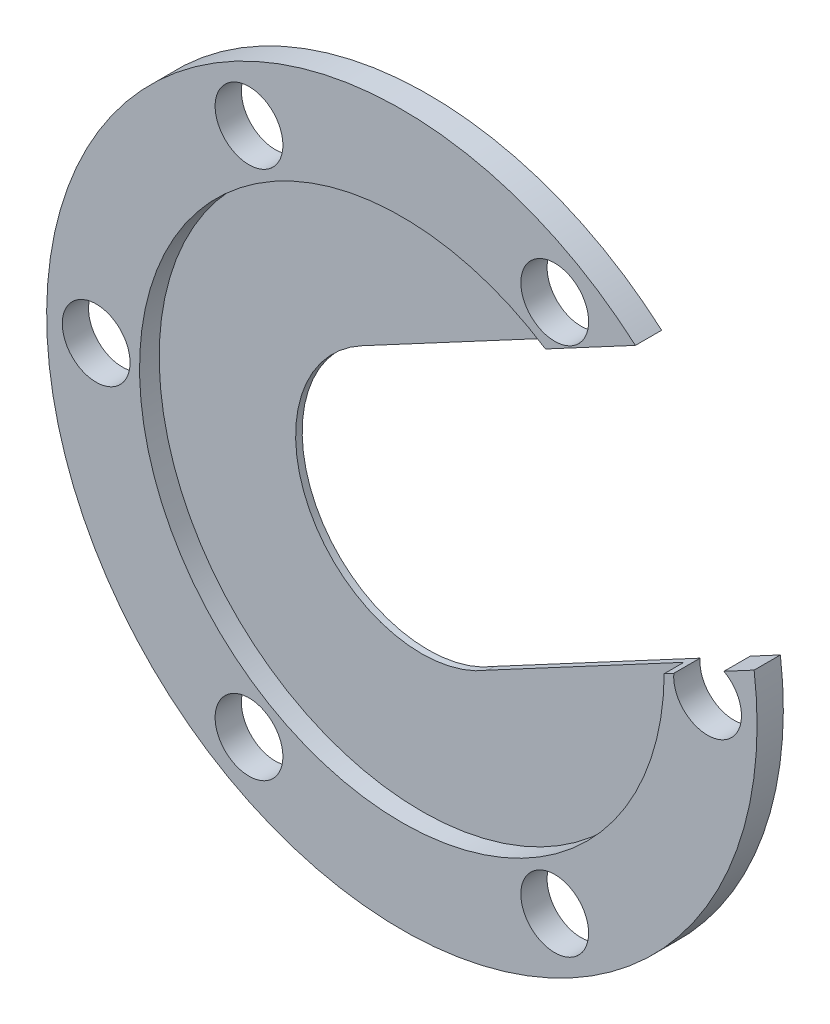
ISO-10303-21;
HEADER;
FILE_DESCRIPTION(('STEP AP214'),'2;1');
FILE_NAME('part.step','',(''),(''),'','','');
FILE_SCHEMA(('AUTOMOTIVE_DESIGN { 1 0 10303 214 1 1 1 1 }'));
ENDSEC;
DATA;
#1=APPLICATION_CONTEXT('core data for automotive mechanical design processes');
#2=APPLICATION_PROTOCOL_DEFINITION('international standard','automotive_design',2000,#1);
#3=PRODUCT_CONTEXT('',#1,'mechanical');
#4=PRODUCT('Part','Part','',(#3));
#5=PRODUCT_RELATED_PRODUCT_CATEGORY('part','',(#4));
#6=PRODUCT_DEFINITION_FORMATION('','',#4);
#7=PRODUCT_DEFINITION_CONTEXT('part definition',#1,'design');
#8=PRODUCT_DEFINITION('design','',#6,#7);
#9=PRODUCT_DEFINITION_SHAPE('','',#8);
#10=(LENGTH_UNIT() NAMED_UNIT(*) SI_UNIT(.MILLI.,.METRE.));
#11=(NAMED_UNIT(*) PLANE_ANGLE_UNIT() SI_UNIT($,.RADIAN.));
#12=(NAMED_UNIT(*) SI_UNIT($,.STERADIAN.) SOLID_ANGLE_UNIT());
#13=UNCERTAINTY_MEASURE_WITH_UNIT(LENGTH_MEASURE(1.E-05),#10,'distance_accuracy_value','');
#14=(GEOMETRIC_REPRESENTATION_CONTEXT(3) GLOBAL_UNCERTAINTY_ASSIGNED_CONTEXT((#13)) GLOBAL_UNIT_ASSIGNED_CONTEXT((#10,
#11,#12)) REPRESENTATION_CONTEXT('',''));
#15=CARTESIAN_POINT('',(0.,0.,0.));
#16=DIRECTION('',(0.,0.,1.));
#17=DIRECTION('',(1.,0.,0.));
#18=AXIS2_PLACEMENT_3D('',#15,#16,#17);
#19=CARTESIAN_POINT('',(-4.33427512630535E-09,0.,3.175));
#20=DIRECTION('',(0.,0.,1.));
#21=DIRECTION('',(1.,0.,0.));
#22=AXIS2_PLACEMENT_3D('',#19,#20,#21);
#23=PLANE('',#22);
#24=CARTESIAN_POINT('',(-36.9951,0.,3.175));
#25=DIRECTION('',(0.,0.,1.));
#26=DIRECTION('',(1.,0.,0.));
#27=AXIS2_PLACEMENT_3D('',#24,#25,#26);
#28=CIRCLE('',#27,4.10210000000001);
#29=CARTESIAN_POINT('',(-32.893,0.,3.175));
#30=VERTEX_POINT('',#29);
#31=EDGE_CURVE('E125',#30,#30,#28,.T.);
#32=ORIENTED_EDGE('',*,*,#31,.F.);
#33=EDGE_LOOP('',(#32));
#34=FACE_BOUND('',#33,.T.);
#35=CARTESIAN_POINT('',(18.49755,-32.0386964254,3.175));
#36=DIRECTION('',(0.,0.,1.));
#37=DIRECTION('',(1.,0.,0.));
#38=AXIS2_PLACEMENT_3D('',#35,#36,#37);
#39=CIRCLE('',#38,4.10210000000002);
#40=CARTESIAN_POINT('',(22.59965,-32.0386964254,3.175));
#41=VERTEX_POINT('',#40);
#42=EDGE_CURVE('E141',#41,#41,#39,.T.);
#43=ORIENTED_EDGE('',*,*,#42,.F.);
#44=EDGE_LOOP('',(#43));
#45=FACE_BOUND('',#44,.T.);
#46=CARTESIAN_POINT('',(18.49755,32.0386964254,3.175));
#47=DIRECTION('',(0.,0.,1.));
#48=DIRECTION('',(1.,0.,0.));
#49=AXIS2_PLACEMENT_3D('',#46,#47,#48);
#50=CIRCLE('',#49,4.10210000000002);
#51=CARTESIAN_POINT('',(22.59965,32.0386964254,3.175));
#52=VERTEX_POINT('',#51);
#53=EDGE_CURVE('E153',#52,#52,#50,.T.);
#54=ORIENTED_EDGE('',*,*,#53,.F.);
#55=EDGE_LOOP('',(#54));
#56=FACE_BOUND('',#55,.T.);
#57=CARTESIAN_POINT('',(-18.49755,32.0386964254,3.175));
#58=DIRECTION('',(0.,0.,1.));
#59=DIRECTION('',(1.,0.,0.));
#60=AXIS2_PLACEMENT_3D('',#57,#58,#59);
#61=CIRCLE('',#60,4.10210000000002);
#62=CARTESIAN_POINT('',(-14.39545,32.0386964254,3.175));
#63=VERTEX_POINT('',#62);
#64=EDGE_CURVE('E159',#63,#63,#61,.T.);
#65=ORIENTED_EDGE('',*,*,#64,.F.);
#66=EDGE_LOOP('',(#65));
#67=FACE_BOUND('',#66,.T.);
#68=CARTESIAN_POINT('',(-18.49755,-32.0386964254,3.175));
#69=DIRECTION('',(0.,0.,1.));
#70=DIRECTION('',(1.,0.,0.));
#71=AXIS2_PLACEMENT_3D('',#68,#69,#70);
#72=CIRCLE('',#71,4.10210000000002);
#73=CARTESIAN_POINT('',(-14.39545,-32.0386964254,3.175));
#74=VERTEX_POINT('',#73);
#75=EDGE_CURVE('E135',#74,#74,#72,.T.);
#76=ORIENTED_EDGE('',*,*,#75,.F.);
#77=EDGE_LOOP('',(#76));
#78=FACE_BOUND('',#77,.T.);
#79=CARTESIAN_POINT('',(-4.33427512630535E-09,0.,3.175));
#80=DIRECTION('',(0.,0.,1.));
#81=DIRECTION('',(1.,0.,0.));
#82=AXIS2_PLACEMENT_3D('',#79,#80,#81);
#83=CIRCLE('',#82,31.75);
#84=CARTESIAN_POINT('',(17.3781643817542,26.571825352619,3.175));
#85=VERTEX_POINT('',#84);
#86=CARTESIAN_POINT('',(31.7488338882831,-0.272114790092504,3.175));
#87=VERTEX_POINT('',#86);
#88=EDGE_CURVE('E114',#85,#87,#83,.T.);
#89=ORIENTED_EDGE('',*,*,#88,.F.);
#90=DIRECTION('',(0.88188321776636,0.471467910066052,0.));
#91=VECTOR('',#90,1.);
#92=CARTESIAN_POINT('',(-7.1851709537409,13.4399002387593,3.175));
#93=LINE('',#92,#91);
#94=CARTESIAN_POINT('',(28.2643352209889,32.3917345092935,3.175));
#95=VERTEX_POINT('',#94);
#96=EDGE_CURVE('E196',#85,#95,#93,.T.);
#97=ORIENTED_EDGE('',*,*,#96,.T.);
#98=CARTESIAN_POINT('',(-4.33427512630535E-09,0.,3.175));
#99=DIRECTION('',(0.,0.,1.));
#100=DIRECTION('',(1.,0.,0.));
#101=AXIS2_PLACEMENT_3D('',#98,#99,#100);
#102=CIRCLE('',#101,42.9895);
#103=CARTESIAN_POINT('',(42.6303494676654,5.54530559529202,3.175));
#104=VERTEX_POINT('',#103);
#105=EDGE_CURVE('E164',#95,#104,#102,.T.);
#106=ORIENTED_EDGE('',*,*,#105,.T.);
#107=DIRECTION('',(0.88188321776636,0.471467910066051,0.));
#108=VECTOR('',#107,1.);
#109=CARTESIAN_POINT('',(6.30706944594742,-13.8736611948441,3.175));
#110=LINE('',#109,#108);
#111=CARTESIAN_POINT('',(38.9764371684633,3.59186962943619,3.175));
#112=VERTEX_POINT('',#111);
#113=EDGE_CURVE('E194',#112,#104,#110,.T.);
#114=ORIENTED_EDGE('',*,*,#113,.F.);
#115=CARTESIAN_POINT('',(36.9951,0.,3.175));
#116=DIRECTION('',(0.,0.,1.));
#117=DIRECTION('',(1.,0.,0.));
#118=AXIS2_PLACEMENT_3D('',#115,#116,#117);
#119=CIRCLE('',#118,4.10210000000001);
#120=CARTESIAN_POINT('',(32.9077414640649,0.347454469993213,3.175));
#121=VERTEX_POINT('',#120);
#122=EDGE_CURVE('E147',#121,#112,#119,.T.);
#123=ORIENTED_EDGE('',*,*,#122,.F.);
#124=EDGE_CURVE('E104',#87,#121,#110,.T.);
#125=ORIENTED_EDGE('',*,*,#124,.F.);
#126=EDGE_LOOP('',(#89,#97,#106,#114,#123,#125));
#127=FACE_BOUND('',#126,.T.);
#128=ADVANCED_FACE('F33',(#34,#45,#56,#67,#78,#127),#23,.T.);
#129=CARTESIAN_POINT('',(-4.33427512630535E-09,0.,0.));
#130=DIRECTION('',(0.,0.,1.));
#131=DIRECTION('',(1.,0.,0.));
#132=AXIS2_PLACEMENT_3D('',#129,#130,#131);
#133=PLANE('',#132);
#134=CARTESIAN_POINT('',(-36.9951,0.,0.));
#135=DIRECTION('',(0.,0.,1.));
#136=DIRECTION('',(1.,0.,0.));
#137=AXIS2_PLACEMENT_3D('',#134,#135,#136);
#138=CIRCLE('',#137,4.10210000000001);
#139=CARTESIAN_POINT('',(-32.893,0.,0.));
#140=VERTEX_POINT('',#139);
#141=EDGE_CURVE('E121',#140,#140,#138,.T.);
#142=ORIENTED_EDGE('',*,*,#141,.T.);
#143=EDGE_LOOP('',(#142));
#144=FACE_BOUND('',#143,.T.);
#145=CARTESIAN_POINT('',(-18.49755,-32.0386964254,0.));
#146=DIRECTION('',(0.,0.,1.));
#147=DIRECTION('',(1.,0.,0.));
#148=AXIS2_PLACEMENT_3D('',#145,#146,#147);
#149=CIRCLE('',#148,4.10210000000002);
#150=CARTESIAN_POINT('',(-14.39545,-32.0386964254,0.));
#151=VERTEX_POINT('',#150);
#152=EDGE_CURVE('E133',#151,#151,#149,.T.);
#153=ORIENTED_EDGE('',*,*,#152,.T.);
#154=EDGE_LOOP('',(#153));
#155=FACE_BOUND('',#154,.T.);
#156=CARTESIAN_POINT('',(18.49755,-32.0386964254,0.));
#157=DIRECTION('',(0.,0.,1.));
#158=DIRECTION('',(1.,0.,0.));
#159=AXIS2_PLACEMENT_3D('',#156,#157,#158);
#160=CIRCLE('',#159,4.10210000000002);
#161=CARTESIAN_POINT('',(22.59965,-32.0386964254,0.));
#162=VERTEX_POINT('',#161);
#163=EDGE_CURVE('E138',#162,#162,#160,.T.);
#164=ORIENTED_EDGE('',*,*,#163,.T.);
#165=EDGE_LOOP('',(#164));
#166=FACE_BOUND('',#165,.T.);
#167=CARTESIAN_POINT('',(18.49755,32.0386964254,0.));
#168=DIRECTION('',(0.,0.,1.));
#169=DIRECTION('',(1.,0.,0.));
#170=AXIS2_PLACEMENT_3D('',#167,#168,#169);
#171=CIRCLE('',#170,4.10210000000002);
#172=CARTESIAN_POINT('',(22.59965,32.0386964254,0.));
#173=VERTEX_POINT('',#172);
#174=EDGE_CURVE('E150',#173,#173,#171,.T.);
#175=ORIENTED_EDGE('',*,*,#174,.T.);
#176=EDGE_LOOP('',(#175));
#177=FACE_BOUND('',#176,.T.);
#178=CARTESIAN_POINT('',(-18.49755,32.0386964254,0.));
#179=DIRECTION('',(0.,0.,1.));
#180=DIRECTION('',(1.,0.,0.));
#181=AXIS2_PLACEMENT_3D('',#178,#179,#180);
#182=CIRCLE('',#181,4.10210000000002);
#183=CARTESIAN_POINT('',(-14.39545,32.0386964254,0.));
#184=VERTEX_POINT('',#183);
#185=EDGE_CURVE('E156',#184,#184,#182,.T.);
#186=ORIENTED_EDGE('',*,*,#185,.T.);
#187=EDGE_LOOP('',(#186));
#188=FACE_BOUND('',#187,.T.);
#189=DIRECTION('',(0.88188321776636,0.471467910066052,0.));
#190=VECTOR('',#189,1.);
#191=CARTESIAN_POINT('',(-7.1851709537409,13.4399002387593,0.));
#192=LINE('',#191,#190);
#193=CARTESIAN_POINT('',(-7.1851709537409,13.4399002387593,0.));
#194=VERTEX_POINT('',#193);
#195=CARTESIAN_POINT('',(28.2643352209889,32.3917345092935,0.));
#196=VERTEX_POINT('',#195);
#197=EDGE_CURVE('E98',#194,#196,#192,.T.);
#198=ORIENTED_EDGE('',*,*,#197,.F.);
#199=CARTESIAN_POINT('',(-4.33427512630535E-09,0.,0.));
#200=DIRECTION('',(0.,0.,1.));
#201=DIRECTION('',(1.,0.,0.));
#202=AXIS2_PLACEMENT_3D('',#199,#200,#201);
#203=CIRCLE('',#202,15.24);
#204=CARTESIAN_POINT('',(8.03359809276662,-12.9506332514768,0.));
#205=VERTEX_POINT('',#204);
#206=EDGE_CURVE('E110',#194,#205,#203,.T.);
#207=ORIENTED_EDGE('',*,*,#206,.T.);
#208=DIRECTION('',(0.88188321776636,0.471467910066051,0.));
#209=VECTOR('',#208,1.);
#210=CARTESIAN_POINT('',(7.17033376935699,-13.4121472231605,0.));
#211=LINE('',#210,#209);
#212=CARTESIAN_POINT('',(32.9077414640649,0.347454469993213,0.));
#213=VERTEX_POINT('',#212);
#214=EDGE_CURVE('E191',#205,#213,#211,.T.);
#215=ORIENTED_EDGE('',*,*,#214,.T.);
#216=CARTESIAN_POINT('',(36.9951,0.,0.));
#217=DIRECTION('',(0.,0.,1.));
#218=DIRECTION('',(1.,0.,0.));
#219=AXIS2_PLACEMENT_3D('',#216,#217,#218);
#220=CIRCLE('',#219,4.10210000000001);
#221=CARTESIAN_POINT('',(38.9764371684633,3.59186962943619,0.));
#222=VERTEX_POINT('',#221);
#223=EDGE_CURVE('E144',#213,#222,#220,.T.);
#224=ORIENTED_EDGE('',*,*,#223,.T.);
#225=CARTESIAN_POINT('',(42.6303494676654,5.54530559529202,0.));
#226=VERTEX_POINT('',#225);
#227=EDGE_CURVE('E48',#222,#226,#211,.T.);
#228=ORIENTED_EDGE('',*,*,#227,.T.);
#229=CARTESIAN_POINT('',(-4.33427512630535E-09,0.,0.));
#230=DIRECTION('',(0.,0.,1.));
#231=DIRECTION('',(1.,0.,0.));
#232=AXIS2_PLACEMENT_3D('',#229,#230,#231);
#233=CIRCLE('',#232,42.9895);
#234=EDGE_CURVE('E113',#196,#226,#233,.T.);
#235=ORIENTED_EDGE('',*,*,#234,.F.);
#236=EDGE_LOOP('',(#198,#207,#215,#224,#228,#235));
#237=FACE_BOUND('',#236,.T.);
#238=ADVANCED_FACE('F108',(#144,#155,#166,#177,#188,#237),#133,.F.);
#239=CARTESIAN_POINT('',(-4.33427512630535E-09,0.,3.175));
#240=DIRECTION('',(0.,0.,-1.));
#241=DIRECTION('',(-1.,0.,0.));
#242=AXIS2_PLACEMENT_3D('',#239,#240,#241);
#243=CYLINDRICAL_SURFACE('',#242,42.9895);
#244=DIRECTION('',(0.,0.,-1.));
#245=VECTOR('',#244,1.);
#246=CARTESIAN_POINT('',(28.2643352209889,32.3917345092935,3.175));
#247=LINE('',#246,#245);
#248=EDGE_CURVE('E115',#196,#95,#247,.F.);
#249=ORIENTED_EDGE('',*,*,#248,.F.);
#250=ORIENTED_EDGE('',*,*,#234,.T.);
#251=DIRECTION('',(0.,0.,-1.));
#252=VECTOR('',#251,1.);
#253=CARTESIAN_POINT('',(42.6303494676654,5.54530559529202,3.175));
#254=LINE('',#253,#252);
#255=EDGE_CURVE('E184',#226,#104,#254,.F.);
#256=ORIENTED_EDGE('',*,*,#255,.T.);
#257=ORIENTED_EDGE('',*,*,#105,.F.);
#258=EDGE_LOOP('',(#249,#250,#256,#257));
#259=FACE_BOUND('',#258,.T.);
#260=ADVANCED_FACE('F35',(#259),#243,.T.);
#261=CARTESIAN_POINT('',(-4.33427512630535E-09,0.,0.79375));
#262=DIRECTION('',(0.,0.,1.));
#263=DIRECTION('',(1.,0.,0.));
#264=AXIS2_PLACEMENT_3D('',#261,#262,#263);
#265=CYLINDRICAL_SURFACE('',#264,31.75);
#266=DIRECTION('',(0.,0.,1.));
#267=VECTOR('',#266,1.);
#268=CARTESIAN_POINT('',(17.3781643817542,26.571825352619,0.79375));
#269=LINE('',#268,#267);
#270=CARTESIAN_POINT('',(17.3781643817542,26.571825352619,0.79375));
#271=VERTEX_POINT('',#270);
#272=EDGE_CURVE('E56',#85,#271,#269,.F.);
#273=ORIENTED_EDGE('',*,*,#272,.F.);
#274=ORIENTED_EDGE('',*,*,#88,.T.);
#275=DIRECTION('',(0.,0.,1.));
#276=VECTOR('',#275,1.);
#277=CARTESIAN_POINT('',(31.7488338882832,-0.272114790092511,0.79375));
#278=LINE('',#277,#276);
#279=CARTESIAN_POINT('',(31.7488338882832,-0.272114790092509,0.79375));
#280=VERTEX_POINT('',#279);
#281=EDGE_CURVE('E103',#87,#280,#278,.F.);
#282=ORIENTED_EDGE('',*,*,#281,.T.);
#283=CARTESIAN_POINT('',(-4.33427512630535E-09,0.,0.79375));
#284=DIRECTION('',(0.,0.,1.));
#285=DIRECTION('',(1.,0.,0.));
#286=AXIS2_PLACEMENT_3D('',#283,#284,#285);
#287=CIRCLE('',#286,31.75);
#288=EDGE_CURVE('E127',#271,#280,#287,.T.);
#289=ORIENTED_EDGE('',*,*,#288,.F.);
#290=EDGE_LOOP('',(#273,#274,#282,#289));
#291=FACE_BOUND('',#290,.T.);
#292=ADVANCED_FACE('F177',(#291),#265,.F.);
#293=CARTESIAN_POINT('',(-4.33427512630535E-09,0.,0.79375));
#294=DIRECTION('',(0.,0.,1.));
#295=DIRECTION('',(1.,0.,0.));
#296=AXIS2_PLACEMENT_3D('',#293,#294,#295);
#297=PLANE('',#296);
#298=CARTESIAN_POINT('',(-4.33427512630535E-09,0.,0.79375));
#299=DIRECTION('',(0.,0.,1.));
#300=DIRECTION('',(1.,0.,0.));
#301=AXIS2_PLACEMENT_3D('',#298,#299,#300);
#302=CIRCLE('',#301,15.24);
#303=CARTESIAN_POINT('',(-7.1851709537409,13.4399002387593,0.79375));
#304=VERTEX_POINT('',#303);
#305=CARTESIAN_POINT('',(8.03359809276662,-12.9506332514768,0.79375));
#306=VERTEX_POINT('',#305);
#307=EDGE_CURVE('E122',#304,#306,#302,.T.);
#308=ORIENTED_EDGE('',*,*,#307,.F.);
#309=DIRECTION('',(0.88188321776636,0.471467910066052,0.));
#310=VECTOR('',#309,1.);
#311=CARTESIAN_POINT('',(-7.1851709537409,13.4399002387593,0.79375));
#312=LINE('',#311,#310);
#313=EDGE_CURVE('E11',#304,#271,#312,.T.);
#314=ORIENTED_EDGE('',*,*,#313,.T.);
#315=ORIENTED_EDGE('',*,*,#288,.T.);
#316=DIRECTION('',(0.88188321776636,0.471467910066051,0.));
#317=VECTOR('',#316,1.);
#318=CARTESIAN_POINT('',(7.17033376935699,-13.4121472231605,0.79375));
#319=LINE('',#318,#317);
#320=EDGE_CURVE('E41',#306,#280,#319,.T.);
#321=ORIENTED_EDGE('',*,*,#320,.F.);
#322=EDGE_LOOP('',(#308,#314,#315,#321));
#323=FACE_BOUND('',#322,.T.);
#324=ADVANCED_FACE('F180',(#323),#297,.T.);
#325=CARTESIAN_POINT('',(-4.33427512630535E-09,0.,3.175));
#326=DIRECTION('',(0.,0.,-1.));
#327=DIRECTION('',(-1.,0.,0.));
#328=AXIS2_PLACEMENT_3D('',#325,#326,#327);
#329=CYLINDRICAL_SURFACE('',#328,15.24);
#330=DIRECTION('',(0.,0.,1.));
#331=VECTOR('',#330,1.);
#332=CARTESIAN_POINT('',(-7.1851709537409,13.4399002387593,-0.9525));
#333=LINE('',#332,#331);
#334=EDGE_CURVE('E95',#194,#304,#333,.T.);
#335=ORIENTED_EDGE('',*,*,#334,.T.);
#336=ORIENTED_EDGE('',*,*,#307,.T.);
#337=DIRECTION('',(0.,0.,-1.));
#338=VECTOR('',#337,1.);
#339=CARTESIAN_POINT('',(8.03359809276662,-12.9506332514768,3.175));
#340=LINE('',#339,#338);
#341=EDGE_CURVE('E120',#205,#306,#340,.F.);
#342=ORIENTED_EDGE('',*,*,#341,.F.);
#343=ORIENTED_EDGE('',*,*,#206,.F.);
#344=EDGE_LOOP('',(#335,#336,#342,#343));
#345=FACE_BOUND('',#344,.T.);
#346=ADVANCED_FACE('F118',(#345),#329,.F.);
#347=CARTESIAN_POINT('',(-18.49755,32.0386964254,3.175));
#348=DIRECTION('',(0.,0.,-1.));
#349=DIRECTION('',(-1.,0.,0.));
#350=AXIS2_PLACEMENT_3D('',#347,#348,#349);
#351=CYLINDRICAL_SURFACE('',#350,4.10210000000002);
#352=ORIENTED_EDGE('',*,*,#64,.T.);
#353=EDGE_LOOP('',(#352));
#354=FACE_BOUND('',#353,.T.);
#355=ORIENTED_EDGE('',*,*,#185,.F.);
#356=EDGE_LOOP('',(#355));
#357=FACE_BOUND('',#356,.T.);
#358=ADVANCED_FACE('F219',(#354,#357),#351,.F.);
#359=CARTESIAN_POINT('',(18.49755,32.0386964254,3.175));
#360=DIRECTION('',(0.,0.,-1.));
#361=DIRECTION('',(-1.,0.,0.));
#362=AXIS2_PLACEMENT_3D('',#359,#360,#361);
#363=CYLINDRICAL_SURFACE('',#362,4.10210000000002);
#364=ORIENTED_EDGE('',*,*,#53,.T.);
#365=EDGE_LOOP('',(#364));
#366=FACE_BOUND('',#365,.T.);
#367=ORIENTED_EDGE('',*,*,#174,.F.);
#368=EDGE_LOOP('',(#367));
#369=FACE_BOUND('',#368,.T.);
#370=ADVANCED_FACE('F210',(#366,#369),#363,.F.);
#371=CARTESIAN_POINT('',(36.9951,0.,3.175));
#372=DIRECTION('',(0.,0.,-1.));
#373=DIRECTION('',(-1.,0.,0.));
#374=AXIS2_PLACEMENT_3D('',#371,#372,#373);
#375=CYLINDRICAL_SURFACE('',#374,4.10210000000001);
#376=DIRECTION('',(0.,0.,-1.));
#377=VECTOR('',#376,1.);
#378=CARTESIAN_POINT('',(32.9077414640649,0.347454469993213,3.175));
#379=LINE('',#378,#377);
#380=EDGE_CURVE('E189',#121,#213,#379,.T.);
#381=ORIENTED_EDGE('',*,*,#380,.F.);
#382=ORIENTED_EDGE('',*,*,#122,.T.);
#383=DIRECTION('',(0.,0.,-1.));
#384=VECTOR('',#383,1.);
#385=CARTESIAN_POINT('',(38.9764371684633,3.59186962943619,3.175));
#386=LINE('',#385,#384);
#387=EDGE_CURVE('E187',#222,#112,#386,.F.);
#388=ORIENTED_EDGE('',*,*,#387,.F.);
#389=ORIENTED_EDGE('',*,*,#223,.F.);
#390=EDGE_LOOP('',(#381,#382,#388,#389));
#391=FACE_BOUND('',#390,.T.);
#392=ADVANCED_FACE('F206',(#391),#375,.F.);
#393=CARTESIAN_POINT('',(18.49755,-32.0386964254,3.175));
#394=DIRECTION('',(0.,0.,-1.));
#395=DIRECTION('',(-1.,0.,0.));
#396=AXIS2_PLACEMENT_3D('',#393,#394,#395);
#397=CYLINDRICAL_SURFACE('',#396,4.10210000000002);
#398=ORIENTED_EDGE('',*,*,#42,.T.);
#399=EDGE_LOOP('',(#398));
#400=FACE_BOUND('',#399,.T.);
#401=ORIENTED_EDGE('',*,*,#163,.F.);
#402=EDGE_LOOP('',(#401));
#403=FACE_BOUND('',#402,.T.);
#404=ADVANCED_FACE('F209',(#400,#403),#397,.F.);
#405=CARTESIAN_POINT('',(-18.49755,-32.0386964254,3.175));
#406=DIRECTION('',(0.,0.,-1.));
#407=DIRECTION('',(-1.,0.,0.));
#408=AXIS2_PLACEMENT_3D('',#405,#406,#407);
#409=CYLINDRICAL_SURFACE('',#408,4.10210000000002);
#410=ORIENTED_EDGE('',*,*,#75,.T.);
#411=EDGE_LOOP('',(#410));
#412=FACE_BOUND('',#411,.T.);
#413=ORIENTED_EDGE('',*,*,#152,.F.);
#414=EDGE_LOOP('',(#413));
#415=FACE_BOUND('',#414,.T.);
#416=ADVANCED_FACE('F216',(#412,#415),#409,.F.);
#417=CARTESIAN_POINT('',(-36.9951,0.,3.175));
#418=DIRECTION('',(0.,0.,-1.));
#419=DIRECTION('',(-1.,0.,0.));
#420=AXIS2_PLACEMENT_3D('',#417,#418,#419);
#421=CYLINDRICAL_SURFACE('',#420,4.10210000000001);
#422=ORIENTED_EDGE('',*,*,#31,.T.);
#423=EDGE_LOOP('',(#422));
#424=FACE_BOUND('',#423,.T.);
#425=ORIENTED_EDGE('',*,*,#141,.F.);
#426=EDGE_LOOP('',(#425));
#427=FACE_BOUND('',#426,.T.);
#428=ADVANCED_FACE('F248',(#424,#427),#421,.F.);
#429=CARTESIAN_POINT('',(6.30706944594742,-13.8736611948441,-0.9525));
#430=DIRECTION('',(0.471467910066051,-0.88188321776636,0.));
#431=DIRECTION('',(0.88188321776636,0.471467910066051,0.));
#432=AXIS2_PLACEMENT_3D('',#429,#430,#431);
#433=PLANE('',#432);
#434=ORIENTED_EDGE('',*,*,#380,.T.);
#435=ORIENTED_EDGE('',*,*,#214,.F.);
#436=ORIENTED_EDGE('',*,*,#341,.T.);
#437=ORIENTED_EDGE('',*,*,#320,.T.);
#438=ORIENTED_EDGE('',*,*,#281,.F.);
#439=ORIENTED_EDGE('',*,*,#124,.T.);
#440=EDGE_LOOP('',(#434,#435,#436,#437,#438,#439));
#441=FACE_BOUND('',#440,.T.);
#442=ADVANCED_FACE('F170',(#441),#433,.F.);
#443=CARTESIAN_POINT('',(-7.1851709537409,13.4399002387593,-0.9525));
#444=DIRECTION('',(0.471467910066052,-0.88188321776636,0.));
#445=DIRECTION('',(0.88188321776636,0.471467910066052,0.));
#446=AXIS2_PLACEMENT_3D('',#443,#444,#445);
#447=PLANE('',#446);
#448=ORIENTED_EDGE('',*,*,#197,.T.);
#449=ORIENTED_EDGE('',*,*,#248,.T.);
#450=ORIENTED_EDGE('',*,*,#96,.F.);
#451=ORIENTED_EDGE('',*,*,#272,.T.);
#452=ORIENTED_EDGE('',*,*,#313,.F.);
#453=ORIENTED_EDGE('',*,*,#334,.F.);
#454=EDGE_LOOP('',(#448,#449,#450,#451,#452,#453));
#455=FACE_BOUND('',#454,.T.);
#456=ADVANCED_FACE('F97',(#455),#447,.T.);
#457=ORIENTED_EDGE('',*,*,#227,.F.);
#458=ORIENTED_EDGE('',*,*,#387,.T.);
#459=ORIENTED_EDGE('',*,*,#113,.T.);
#460=ORIENTED_EDGE('',*,*,#255,.F.);
#461=EDGE_LOOP('',(#457,#458,#459,#460));
#462=FACE_BOUND('',#461,.T.);
#463=ADVANCED_FACE('F202',(#462),#433,.F.);
#464=CLOSED_SHELL('',(#128,#238,#260,#292,#324,#346,#358,#370,#392,#404,#416,#428,#442,#456,#463));
#465=MANIFOLD_SOLID_BREP('B2',#464);
#466=ADVANCED_BREP_SHAPE_REPRESENTATION('',(#18,#465),#14);
#467=SHAPE_DEFINITION_REPRESENTATION(#9,#466);
ENDSEC;
END-ISO-10303-21;
